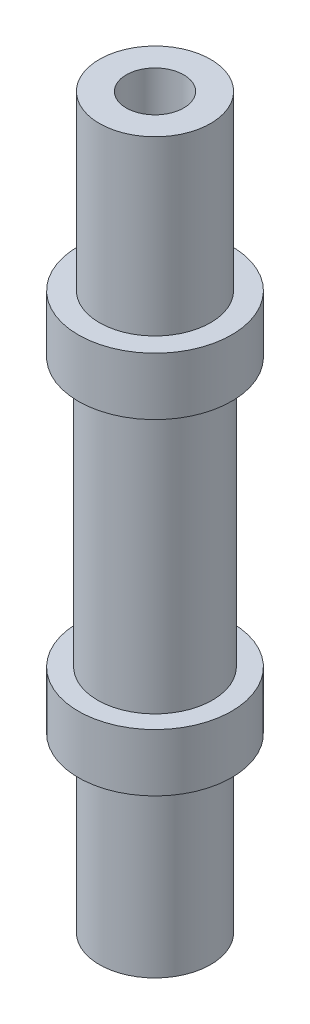
ISO-10303-21;
HEADER;
FILE_DESCRIPTION(('STEP AP214'),'2;1');
FILE_NAME('part.step','',(''),(''),'','','');
FILE_SCHEMA(('AUTOMOTIVE_DESIGN { 1 0 10303 214 1 1 1 1 }'));
ENDSEC;
DATA;
#1=APPLICATION_CONTEXT('core data for automotive mechanical design processes');
#2=APPLICATION_PROTOCOL_DEFINITION('international standard','automotive_design',2000,#1);
#3=PRODUCT_CONTEXT('',#1,'mechanical');
#4=PRODUCT('Part','Part','',(#3));
#5=PRODUCT_RELATED_PRODUCT_CATEGORY('part','',(#4));
#6=PRODUCT_DEFINITION_FORMATION('','',#4);
#7=PRODUCT_DEFINITION_CONTEXT('part definition',#1,'design');
#8=PRODUCT_DEFINITION('design','',#6,#7);
#9=PRODUCT_DEFINITION_SHAPE('','',#8);
#10=(LENGTH_UNIT() NAMED_UNIT(*) SI_UNIT(.MILLI.,.METRE.));
#11=(NAMED_UNIT(*) PLANE_ANGLE_UNIT() SI_UNIT($,.RADIAN.));
#12=(NAMED_UNIT(*) SI_UNIT($,.STERADIAN.) SOLID_ANGLE_UNIT());
#13=UNCERTAINTY_MEASURE_WITH_UNIT(LENGTH_MEASURE(1.E-05),#10,'distance_accuracy_value','');
#14=(GEOMETRIC_REPRESENTATION_CONTEXT(3) GLOBAL_UNCERTAINTY_ASSIGNED_CONTEXT((#13)) GLOBAL_UNIT_ASSIGNED_CONTEXT((#10,
#11,#12)) REPRESENTATION_CONTEXT('',''));
#15=CARTESIAN_POINT('',(0.,0.,0.));
#16=DIRECTION('',(0.,0.,1.));
#17=DIRECTION('',(1.,0.,0.));
#18=AXIS2_PLACEMENT_3D('',#15,#16,#17);
#19=CARTESIAN_POINT('',(0.,7.,0.));
#20=DIRECTION('',(0.,-1.,0.));
#21=DIRECTION('',(0.,0.,-1.));
#22=AXIS2_PLACEMENT_3D('',#19,#20,#21);
#23=CYLINDRICAL_SURFACE('',#22,3.);
#24=CARTESIAN_POINT('',(0.,7.,0.));
#25=DIRECTION('',(0.,1.,0.));
#26=DIRECTION('',(0.,0.,1.));
#27=AXIS2_PLACEMENT_3D('',#24,#25,#26);
#28=CIRCLE('',#27,3.);
#29=CARTESIAN_POINT('',(0.,7.,3.));
#30=VERTEX_POINT('',#29);
#31=EDGE_CURVE('E49',#30,#30,#28,.T.);
#32=ORIENTED_EDGE('',*,*,#31,.F.);
#33=EDGE_LOOP('',(#32));
#34=FACE_BOUND('',#33,.T.);
#35=CARTESIAN_POINT('',(0.,-7.,0.));
#36=DIRECTION('',(0.,1.,0.));
#37=DIRECTION('',(0.,0.,1.));
#38=AXIS2_PLACEMENT_3D('',#35,#36,#37);
#39=CIRCLE('',#38,3.);
#40=CARTESIAN_POINT('',(0.,-7.,3.));
#41=VERTEX_POINT('',#40);
#42=EDGE_CURVE('E54',#41,#41,#39,.T.);
#43=ORIENTED_EDGE('',*,*,#42,.T.);
#44=EDGE_LOOP('',(#43));
#45=FACE_BOUND('',#44,.T.);
#46=ADVANCED_FACE('F37',(#34,#45),#23,.T.);
#47=CARTESIAN_POINT('',(0.,-10.,0.));
#48=DIRECTION('',(0.,1.,0.));
#49=DIRECTION('',(0.,0.,1.));
#50=AXIS2_PLACEMENT_3D('',#47,#48,#49);
#51=CYLINDRICAL_SURFACE('',#50,4.);
#52=CARTESIAN_POINT('',(0.,-10.,0.));
#53=DIRECTION('',(0.,-1.,0.));
#54=DIRECTION('',(0.,0.,-1.));
#55=AXIS2_PLACEMENT_3D('',#52,#53,#54);
#56=CIRCLE('',#55,4.);
#57=CARTESIAN_POINT('',(0.,-10.,-4.));
#58=VERTEX_POINT('',#57);
#59=EDGE_CURVE('E59',#58,#58,#56,.T.);
#60=ORIENTED_EDGE('',*,*,#59,.F.);
#61=EDGE_LOOP('',(#60));
#62=FACE_BOUND('',#61,.T.);
#63=CARTESIAN_POINT('',(0.,-7.,0.));
#64=DIRECTION('',(0.,-1.,0.));
#65=DIRECTION('',(0.,0.,-1.));
#66=AXIS2_PLACEMENT_3D('',#63,#64,#65);
#67=CIRCLE('',#66,4.);
#68=CARTESIAN_POINT('',(0.,-7.,-4.));
#69=VERTEX_POINT('',#68);
#70=EDGE_CURVE('E61',#69,#69,#67,.T.);
#71=ORIENTED_EDGE('',*,*,#70,.T.);
#72=EDGE_LOOP('',(#71));
#73=FACE_BOUND('',#72,.T.);
#74=ADVANCED_FACE('F121',(#62,#73),#51,.T.);
#75=CARTESIAN_POINT('',(0.,-10.,0.));
#76=DIRECTION('',(0.,-1.,0.));
#77=DIRECTION('',(0.,0.,-1.));
#78=AXIS2_PLACEMENT_3D('',#75,#76,#77);
#79=PLANE('',#78);
#80=CARTESIAN_POINT('',(0.,-10.,0.));
#81=DIRECTION('',(0.,-1.,0.));
#82=DIRECTION('',(0.,0.,-1.));
#83=AXIS2_PLACEMENT_3D('',#80,#81,#82);
#84=CIRCLE('',#83,2.9);
#85=CARTESIAN_POINT('',(0.,-10.,-2.9));
#86=VERTEX_POINT('',#85);
#87=EDGE_CURVE('E77',#86,#86,#84,.T.);
#88=ORIENTED_EDGE('',*,*,#87,.F.);
#89=EDGE_LOOP('',(#88));
#90=FACE_BOUND('',#89,.T.);
#91=ORIENTED_EDGE('',*,*,#59,.T.);
#92=EDGE_LOOP('',(#91));
#93=FACE_BOUND('',#92,.T.);
#94=ADVANCED_FACE('F118',(#90,#93),#79,.T.);
#95=CARTESIAN_POINT('',(0.,-7.,0.));
#96=DIRECTION('',(0.,-1.,0.));
#97=DIRECTION('',(0.,0.,-1.));
#98=AXIS2_PLACEMENT_3D('',#95,#96,#97);
#99=PLANE('',#98);
#100=ORIENTED_EDGE('',*,*,#42,.F.);
#101=EDGE_LOOP('',(#100));
#102=FACE_BOUND('',#101,.T.);
#103=ORIENTED_EDGE('',*,*,#70,.F.);
#104=EDGE_LOOP('',(#103));
#105=FACE_BOUND('',#104,.T.);
#106=ADVANCED_FACE('F131',(#102,#105),#99,.F.);
#107=CARTESIAN_POINT('',(0.,10.,0.));
#108=DIRECTION('',(0.,-1.,0.));
#109=DIRECTION('',(0.,0.,-1.));
#110=AXIS2_PLACEMENT_3D('',#107,#108,#109);
#111=CYLINDRICAL_SURFACE('',#110,4.);
#112=CARTESIAN_POINT('',(0.,10.,0.));
#113=DIRECTION('',(0.,1.,0.));
#114=DIRECTION('',(0.,0.,1.));
#115=AXIS2_PLACEMENT_3D('',#112,#113,#114);
#116=CIRCLE('',#115,4.);
#117=CARTESIAN_POINT('',(0.,10.,4.));
#118=VERTEX_POINT('',#117);
#119=EDGE_CURVE('E65',#118,#118,#116,.T.);
#120=ORIENTED_EDGE('',*,*,#119,.F.);
#121=EDGE_LOOP('',(#120));
#122=FACE_BOUND('',#121,.T.);
#123=CARTESIAN_POINT('',(0.,7.,0.));
#124=DIRECTION('',(0.,1.,0.));
#125=DIRECTION('',(0.,0.,1.));
#126=AXIS2_PLACEMENT_3D('',#123,#124,#125);
#127=CIRCLE('',#126,4.);
#128=CARTESIAN_POINT('',(0.,7.,4.));
#129=VERTEX_POINT('',#128);
#130=EDGE_CURVE('E69',#129,#129,#127,.T.);
#131=ORIENTED_EDGE('',*,*,#130,.T.);
#132=EDGE_LOOP('',(#131));
#133=FACE_BOUND('',#132,.T.);
#134=ADVANCED_FACE('F134',(#122,#133),#111,.T.);
#135=CARTESIAN_POINT('',(0.,10.,0.));
#136=DIRECTION('',(0.,1.,0.));
#137=DIRECTION('',(0.,0.,1.));
#138=AXIS2_PLACEMENT_3D('',#135,#136,#137);
#139=PLANE('',#138);
#140=CARTESIAN_POINT('',(0.,10.,0.));
#141=DIRECTION('',(0.,1.,0.));
#142=DIRECTION('',(0.,0.,1.));
#143=AXIS2_PLACEMENT_3D('',#140,#141,#142);
#144=CIRCLE('',#143,2.9);
#145=CARTESIAN_POINT('',(0.,10.,2.9));
#146=VERTEX_POINT('',#145);
#147=EDGE_CURVE('E89',#146,#146,#144,.T.);
#148=ORIENTED_EDGE('',*,*,#147,.F.);
#149=EDGE_LOOP('',(#148));
#150=FACE_BOUND('',#149,.T.);
#151=ORIENTED_EDGE('',*,*,#119,.T.);
#152=EDGE_LOOP('',(#151));
#153=FACE_BOUND('',#152,.T.);
#154=ADVANCED_FACE('F142',(#150,#153),#139,.T.);
#155=CARTESIAN_POINT('',(0.,7.,0.));
#156=DIRECTION('',(0.,1.,0.));
#157=DIRECTION('',(0.,0.,1.));
#158=AXIS2_PLACEMENT_3D('',#155,#156,#157);
#159=PLANE('',#158);
#160=ORIENTED_EDGE('',*,*,#31,.T.);
#161=EDGE_LOOP('',(#160));
#162=FACE_BOUND('',#161,.T.);
#163=ORIENTED_EDGE('',*,*,#130,.F.);
#164=EDGE_LOOP('',(#163));
#165=FACE_BOUND('',#164,.T.);
#166=ADVANCED_FACE('F147',(#162,#165),#159,.F.);
#167=CARTESIAN_POINT('',(0.,-19.,0.));
#168=DIRECTION('',(0.,-1.,0.));
#169=DIRECTION('',(0.,0.,-1.));
#170=AXIS2_PLACEMENT_3D('',#167,#168,#169);
#171=PLANE('',#170);
#172=CARTESIAN_POINT('',(0.,-19.,0.));
#173=DIRECTION('',(0.,-1.,0.));
#174=DIRECTION('',(0.,0.,-1.));
#175=AXIS2_PLACEMENT_3D('',#172,#173,#174);
#176=CIRCLE('',#175,2.9);
#177=CARTESIAN_POINT('',(0.,-19.,-2.9));
#178=VERTEX_POINT('',#177);
#179=EDGE_CURVE('E73',#178,#178,#176,.T.);
#180=ORIENTED_EDGE('',*,*,#179,.T.);
#181=EDGE_LOOP('',(#180));
#182=FACE_BOUND('',#181,.T.);
#183=CARTESIAN_POINT('',(0.,-19.,0.));
#184=DIRECTION('',(0.,-1.,0.));
#185=DIRECTION('',(0.,0.,-1.));
#186=AXIS2_PLACEMENT_3D('',#183,#184,#185);
#187=CIRCLE('',#186,1.5);
#188=CARTESIAN_POINT('',(0.,-19.,-1.5));
#189=VERTEX_POINT('',#188);
#190=EDGE_CURVE('E81',#189,#189,#187,.T.);
#191=ORIENTED_EDGE('',*,*,#190,.F.);
#192=EDGE_LOOP('',(#191));
#193=FACE_BOUND('',#192,.T.);
#194=ADVANCED_FACE('F150',(#182,#193),#171,.T.);
#195=CARTESIAN_POINT('',(0.,-19.,0.));
#196=DIRECTION('',(0.,1.,0.));
#197=DIRECTION('',(0.,0.,1.));
#198=AXIS2_PLACEMENT_3D('',#195,#196,#197);
#199=CYLINDRICAL_SURFACE('',#198,2.9);
#200=ORIENTED_EDGE('',*,*,#179,.F.);
#201=EDGE_LOOP('',(#200));
#202=FACE_BOUND('',#201,.T.);
#203=ORIENTED_EDGE('',*,*,#87,.T.);
#204=EDGE_LOOP('',(#203));
#205=FACE_BOUND('',#204,.T.);
#206=ADVANCED_FACE('F156',(#202,#205),#199,.T.);
#207=CARTESIAN_POINT('',(0.,-19.,0.));
#208=DIRECTION('',(0.,1.,0.));
#209=DIRECTION('',(0.,0.,1.));
#210=AXIS2_PLACEMENT_3D('',#207,#208,#209);
#211=CYLINDRICAL_SURFACE('',#210,1.5);
#212=ORIENTED_EDGE('',*,*,#190,.T.);
#213=EDGE_LOOP('',(#212));
#214=FACE_BOUND('',#213,.T.);
#215=CARTESIAN_POINT('',(0.,-10.,0.));
#216=DIRECTION('',(0.,-1.,0.));
#217=DIRECTION('',(0.,0.,-1.));
#218=AXIS2_PLACEMENT_3D('',#215,#216,#217);
#219=CIRCLE('',#218,1.5);
#220=CARTESIAN_POINT('',(0.,-10.,-1.5));
#221=VERTEX_POINT('',#220);
#222=EDGE_CURVE('E44',#221,#221,#219,.F.);
#223=ORIENTED_EDGE('',*,*,#222,.T.);
#224=EDGE_LOOP('',(#223));
#225=FACE_BOUND('',#224,.T.);
#226=ADVANCED_FACE('F115',(#214,#225),#211,.F.);
#227=ORIENTED_EDGE('',*,*,#222,.F.);
#228=EDGE_LOOP('',(#227));
#229=FACE_BOUND('',#228,.T.);
#230=ADVANCED_FACE('F106',(#229),#79,.T.);
#231=CARTESIAN_POINT('',(0.,19.,0.));
#232=DIRECTION('',(0.,1.,0.));
#233=DIRECTION('',(0.,0.,1.));
#234=AXIS2_PLACEMENT_3D('',#231,#232,#233);
#235=PLANE('',#234);
#236=CARTESIAN_POINT('',(0.,19.,0.));
#237=DIRECTION('',(0.,1.,0.));
#238=DIRECTION('',(0.,0.,1.));
#239=AXIS2_PLACEMENT_3D('',#236,#237,#238);
#240=CIRCLE('',#239,2.9);
#241=CARTESIAN_POINT('',(0.,19.,2.9));
#242=VERTEX_POINT('',#241);
#243=EDGE_CURVE('E88',#242,#242,#240,.T.);
#244=ORIENTED_EDGE('',*,*,#243,.T.);
#245=EDGE_LOOP('',(#244));
#246=FACE_BOUND('',#245,.T.);
#247=CARTESIAN_POINT('',(0.,19.,0.));
#248=DIRECTION('',(0.,1.,0.));
#249=DIRECTION('',(0.,0.,1.));
#250=AXIS2_PLACEMENT_3D('',#247,#248,#249);
#251=CIRCLE('',#250,1.5);
#252=CARTESIAN_POINT('',(0.,19.,1.5));
#253=VERTEX_POINT('',#252);
#254=EDGE_CURVE('E93',#253,#253,#251,.T.);
#255=ORIENTED_EDGE('',*,*,#254,.F.);
#256=EDGE_LOOP('',(#255));
#257=FACE_BOUND('',#256,.T.);
#258=ADVANCED_FACE('F103',(#246,#257),#235,.T.);
#259=CARTESIAN_POINT('',(0.,19.,0.));
#260=DIRECTION('',(0.,-1.,0.));
#261=DIRECTION('',(0.,0.,-1.));
#262=AXIS2_PLACEMENT_3D('',#259,#260,#261);
#263=CYLINDRICAL_SURFACE('',#262,2.9);
#264=ORIENTED_EDGE('',*,*,#243,.F.);
#265=EDGE_LOOP('',(#264));
#266=FACE_BOUND('',#265,.T.);
#267=ORIENTED_EDGE('',*,*,#147,.T.);
#268=EDGE_LOOP('',(#267));
#269=FACE_BOUND('',#268,.T.);
#270=ADVANCED_FACE('F105',(#266,#269),#263,.T.);
#271=CARTESIAN_POINT('',(0.,19.,0.));
#272=DIRECTION('',(0.,-1.,0.));
#273=DIRECTION('',(0.,0.,-1.));
#274=AXIS2_PLACEMENT_3D('',#271,#272,#273);
#275=CYLINDRICAL_SURFACE('',#274,1.5);
#276=ORIENTED_EDGE('',*,*,#254,.T.);
#277=EDGE_LOOP('',(#276));
#278=FACE_BOUND('',#277,.T.);
#279=CARTESIAN_POINT('',(0.,10.,0.));
#280=DIRECTION('',(0.,1.,0.));
#281=DIRECTION('',(0.,0.,1.));
#282=AXIS2_PLACEMENT_3D('',#279,#280,#281);
#283=CIRCLE('',#282,1.5);
#284=CARTESIAN_POINT('',(0.,10.,1.5));
#285=VERTEX_POINT('',#284);
#286=EDGE_CURVE('E10',#285,#285,#283,.F.);
#287=ORIENTED_EDGE('',*,*,#286,.T.);
#288=EDGE_LOOP('',(#287));
#289=FACE_BOUND('',#288,.T.);
#290=ADVANCED_FACE('F101',(#278,#289),#275,.F.);
#291=ORIENTED_EDGE('',*,*,#286,.F.);
#292=EDGE_LOOP('',(#291));
#293=FACE_BOUND('',#292,.T.);
#294=ADVANCED_FACE('F155',(#293),#139,.T.);
#295=CLOSED_SHELL('',(#46,#74,#94,#106,#134,#154,#166,#194,#206,#226,#230,#258,#270,#290,#294));
#296=MANIFOLD_SOLID_BREP('B2',#295);
#297=ADVANCED_BREP_SHAPE_REPRESENTATION('',(#18,#296),#14);
#298=SHAPE_DEFINITION_REPRESENTATION(#9,#297);
ENDSEC;
END-ISO-10303-21;
